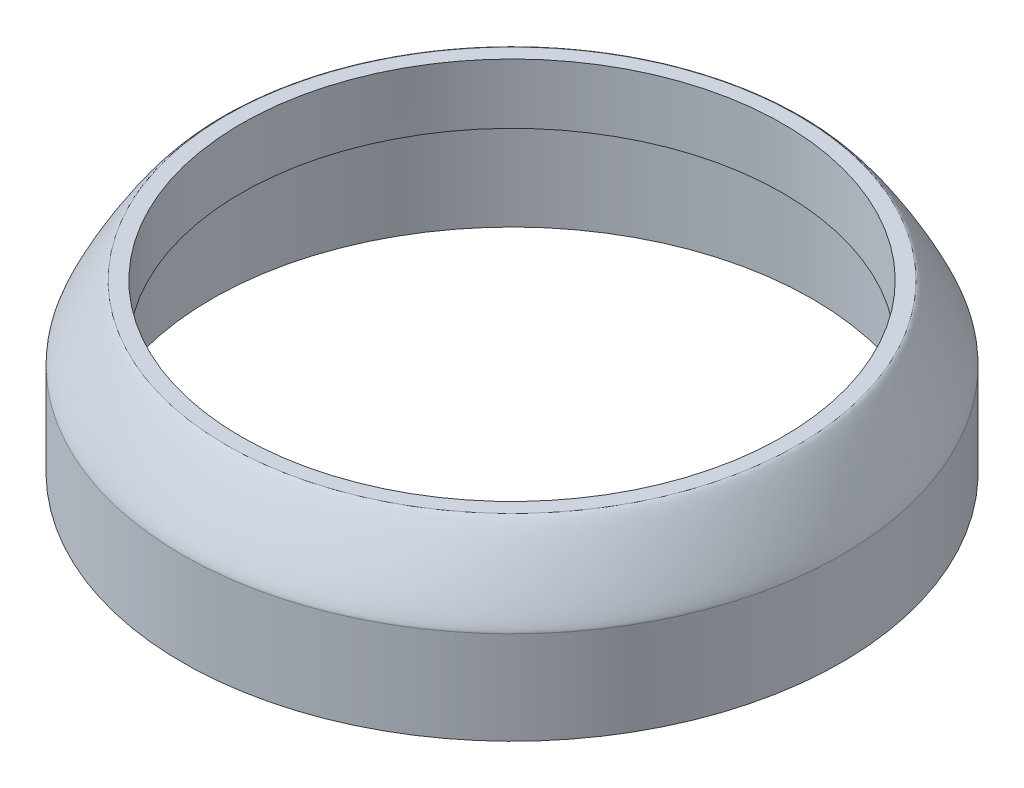
ISO-10303-21;
HEADER;
FILE_DESCRIPTION(('STEP AP214'),'2;1');
FILE_NAME('part.step','',(''),(''),'','','');
FILE_SCHEMA(('AUTOMOTIVE_DESIGN { 1 0 10303 214 1 1 1 1 }'));
ENDSEC;
DATA;
#1=APPLICATION_CONTEXT('core data for automotive mechanical design processes');
#2=APPLICATION_PROTOCOL_DEFINITION('international standard','automotive_design',2000,#1);
#3=PRODUCT_CONTEXT('',#1,'mechanical');
#4=PRODUCT('Part','Part','',(#3));
#5=PRODUCT_RELATED_PRODUCT_CATEGORY('part','',(#4));
#6=PRODUCT_DEFINITION_FORMATION('','',#4);
#7=PRODUCT_DEFINITION_CONTEXT('part definition',#1,'design');
#8=PRODUCT_DEFINITION('design','',#6,#7);
#9=PRODUCT_DEFINITION_SHAPE('','',#8);
#10=(LENGTH_UNIT() NAMED_UNIT(*) SI_UNIT(.MILLI.,.METRE.));
#11=(NAMED_UNIT(*) PLANE_ANGLE_UNIT() SI_UNIT($,.RADIAN.));
#12=(NAMED_UNIT(*) SI_UNIT($,.STERADIAN.) SOLID_ANGLE_UNIT());
#13=UNCERTAINTY_MEASURE_WITH_UNIT(LENGTH_MEASURE(1.E-05),#10,'distance_accuracy_value','');
#14=(GEOMETRIC_REPRESENTATION_CONTEXT(3) GLOBAL_UNCERTAINTY_ASSIGNED_CONTEXT((#13)) GLOBAL_UNIT_ASSIGNED_CONTEXT((#10,
#11,#12)) REPRESENTATION_CONTEXT('',''));
#15=CARTESIAN_POINT('',(0.,0.,0.));
#16=DIRECTION('',(0.,0.,1.));
#17=DIRECTION('',(1.,0.,0.));
#18=AXIS2_PLACEMENT_3D('',#15,#16,#17);
#19=CARTESIAN_POINT('',(0.,65.,0.));
#20=DIRECTION('',(0.,-1.,0.));
#21=DIRECTION('',(0.,0.,-1.));
#22=AXIS2_PLACEMENT_3D('',#19,#20,#21);
#23=CYLINDRICAL_SURFACE('',#22,90.);
#24=CARTESIAN_POINT('',(0.,45.,90.));
#25=CARTESIAN_POINT('',(11.7809724506332,45.,90.));
#26=CARTESIAN_POINT('',(23.5573095926679,45.,87.6575409000106));
#27=CARTESIAN_POINT('',(45.3257082330483,45.,78.640774952021));
#28=CARTESIAN_POINT('',(55.3092047979573,45.,71.9700158156213));
#29=CARTESIAN_POINT('',(71.9700158156213,45.,55.3092047979573));
#30=CARTESIAN_POINT('',(78.6407749520015,45.,45.3257082330954));
#31=CARTESIAN_POINT('',(87.6575409000302,45.,23.5573095926207));
#32=CARTESIAN_POINT('',(90.,45.,11.780972450639));
#33=CARTESIAN_POINT('',(90.,45.,-11.780972450639));
#34=CARTESIAN_POINT('',(87.6575409000405,45.,-23.5573095925958));
#35=CARTESIAN_POINT('',(78.6407749519911,45.,-45.3257082331205));
#36=CARTESIAN_POINT('',(71.9700158156186,45.,-55.30920479796));
#37=CARTESIAN_POINT('',(55.3092047979599,45.,-71.9700158156187));
#38=CARTESIAN_POINT('',(45.3257082330832,45.,-78.6407749520065));
#39=CARTESIAN_POINT('',(23.5573095926332,45.,-87.657540900025));
#40=CARTESIAN_POINT('',(11.780972450639,45.,-90.));
#41=CARTESIAN_POINT('',(-11.780972450639,45.,-90.));
#42=CARTESIAN_POINT('',(-23.5573095926632,45.,-87.6575409000126));
#43=CARTESIAN_POINT('',(-45.3257082330528,45.,-78.6407749520192));
#44=CARTESIAN_POINT('',(-55.3092047979599,45.,-71.9700158156186));
#45=CARTESIAN_POINT('',(-71.9700158156187,45.,-55.3092047979599));
#46=CARTESIAN_POINT('',(-78.6407749519963,45.,-45.3257082331078));
#47=CARTESIAN_POINT('',(-87.6575409000352,45.,-23.5573095926086));
#48=CARTESIAN_POINT('',(-90.,45.,-11.7809724506389));
#49=CARTESIAN_POINT('',(-90.,45.,11.7809724506392));
#50=CARTESIAN_POINT('',(-87.6575409000124,45.,23.5573095926636));
#51=CARTESIAN_POINT('',(-78.6407749520194,45.,45.3257082330523));
#52=CARTESIAN_POINT('',(-71.9700158155886,45.,55.3092047979899));
#53=CARTESIAN_POINT('',(-55.3092047979904,45.,71.9700158155883));
#54=CARTESIAN_POINT('',(-45.3257082330775,45.,78.6407749520089));
#55=CARTESIAN_POINT('',(-23.5573095926389,45.,87.6575409000227));
#56=CARTESIAN_POINT('',(-11.7809724506332,45.,90.));
#57=CARTESIAN_POINT('',(0.,45.,90.));
#58=(BOUNDED_CURVE() B_SPLINE_CURVE(3,(#24,#25,#26,#27,#28,#29,#30,#31,#32,#33,#34,#35,#36,#37,
#38,#39,#40,#41,#42,#43,#44,#45,#46,#47,#48,#49,#50,#51,#52,#53,#54,#55,#56,#57),.UNSPECIFIED.,
.T.,.F.) B_SPLINE_CURVE_WITH_KNOTS((4,2,2,2,2,2,2,2,2,2,2,2,2,2,2,2,4),(0.,0.392699081698724,
0.785398163397448,1.17809724509617,1.5707963267949,1.96349540849362,2.35619449019234,
2.74889357189107,3.14159265358979,3.53429173528852,3.92699081698724,4.31968989868597,
4.71238898038469,5.10508806208341,5.49778714378214,5.89048622548086,6.28318530717959),
.UNSPECIFIED.) CURVE() GEOMETRIC_REPRESENTATION_ITEM() RATIONAL_B_SPLINE_CURVE((1.,1.,1.,1.,1.,
1.,1.,1.,1.,1.,1.,1.,1.,1.,1.,1.,1.,1.,1.,1.,1.,1.,1.,1.,1.,1.,1.,1.,1.,1.,1.,1.,1.,1.)) REPRESENTATION_ITEM(''));
#59=CARTESIAN_POINT('',(0.,45.,90.));
#60=VERTEX_POINT('',#59);
#61=EDGE_CURVE('E12',#60,#60,#58,.F.);
#62=ORIENTED_EDGE('',*,*,#61,.T.);
#63=EDGE_LOOP('',(#62));
#64=FACE_BOUND('',#63,.T.);
#65=CARTESIAN_POINT('',(0.,19.6,0.));
#66=DIRECTION('',(0.,-1.,0.));
#67=DIRECTION('',(0.,0.,-1.));
#68=AXIS2_PLACEMENT_3D('',#65,#66,#67);
#69=CIRCLE('',#68,90.);
#70=CARTESIAN_POINT('',(0.,19.6,-90.));
#71=VERTEX_POINT('',#70);
#72=EDGE_CURVE('E134',#71,#71,#69,.T.);
#73=ORIENTED_EDGE('',*,*,#72,.F.);
#74=EDGE_LOOP('',(#73));
#75=FACE_BOUND('',#74,.T.);
#76=ADVANCED_FACE('F44',(#64,#75),#23,.T.);
#77=CARTESIAN_POINT('',(0.,48.6,0.));
#78=DIRECTION('',(0.,-1.,0.));
#79=DIRECTION('',(0.,0.,-1.));
#80=AXIS2_PLACEMENT_3D('',#77,#78,#79);
#81=CYLINDRICAL_SURFACE('',#80,82.);
#82=CARTESIAN_POINT('',(0.,48.6,0.));
#83=DIRECTION('',(0.,-1.,0.));
#84=DIRECTION('',(0.,0.,-1.));
#85=AXIS2_PLACEMENT_3D('',#82,#83,#84);
#86=CIRCLE('',#85,82.);
#87=CARTESIAN_POINT('',(0.,48.6,-82.));
#88=VERTEX_POINT('',#87);
#89=EDGE_CURVE('E137',#88,#88,#86,.T.);
#90=ORIENTED_EDGE('',*,*,#89,.F.);
#91=EDGE_LOOP('',(#90));
#92=FACE_BOUND('',#91,.T.);
#93=CARTESIAN_POINT('',(0.,19.6,0.));
#94=DIRECTION('',(0.,-1.,0.));
#95=DIRECTION('',(0.,0.,-1.));
#96=AXIS2_PLACEMENT_3D('',#93,#94,#95);
#97=CIRCLE('',#96,82.);
#98=CARTESIAN_POINT('',(0.,19.6,-82.));
#99=VERTEX_POINT('',#98);
#100=EDGE_CURVE('E131',#99,#99,#97,.T.);
#101=ORIENTED_EDGE('',*,*,#100,.T.);
#102=EDGE_LOOP('',(#101));
#103=FACE_BOUND('',#102,.T.);
#104=ADVANCED_FACE('F169',(#92,#103),#81,.F.);
#105=CARTESIAN_POINT('',(0.,35.,0.));
#106=DIRECTION('',(0.,1.,0.));
#107=DIRECTION('',(0.,0.,1.));
#108=AXIS2_PLACEMENT_3D('',#105,#106,#107);
#109=CYLINDRICAL_SURFACE('',#108,74.);
#110=CARTESIAN_POINT('',(0.,65.,0.));
#111=DIRECTION('',(0.,1.,0.));
#112=DIRECTION('',(0.,0.,1.));
#113=AXIS2_PLACEMENT_3D('',#110,#111,#112);
#114=CIRCLE('',#113,74.);
#115=CARTESIAN_POINT('',(0.,65.,74.));
#116=VERTEX_POINT('',#115);
#117=EDGE_CURVE('E141',#116,#116,#114,.T.);
#118=ORIENTED_EDGE('',*,*,#117,.T.);
#119=EDGE_LOOP('',(#118));
#120=FACE_BOUND('',#119,.T.);
#121=CARTESIAN_POINT('',(0.,48.6,0.));
#122=DIRECTION('',(0.,-1.,0.));
#123=DIRECTION('',(0.,0.,-1.));
#124=AXIS2_PLACEMENT_3D('',#121,#122,#123);
#125=CIRCLE('',#124,74.);
#126=CARTESIAN_POINT('',(0.,48.6,-74.));
#127=VERTEX_POINT('',#126);
#128=EDGE_CURVE('E140',#127,#127,#125,.F.);
#129=ORIENTED_EDGE('',*,*,#128,.F.);
#130=EDGE_LOOP('',(#129));
#131=FACE_BOUND('',#130,.T.);
#132=ADVANCED_FACE('F165',(#120,#131),#109,.F.);
#133=CARTESIAN_POINT('',(0.,65.,0.));
#134=DIRECTION('',(0.,1.,0.));
#135=DIRECTION('',(0.,0.,1.));
#136=AXIS2_PLACEMENT_3D('',#133,#134,#135);
#137=PLANE('',#136);
#138=CARTESIAN_POINT('',(0.,65.,78.));
#139=CARTESIAN_POINT('',(-10.2101761238821,65.,78.));
#140=CARTESIAN_POINT('',(-20.4163349802806,65.,75.9698687800081));
#141=CARTESIAN_POINT('',(-39.2822804686736,65.,68.1553382917526));
#142=CARTESIAN_POINT('',(-47.9346441582111,65.,62.3740137068549));
#143=CARTESIAN_POINT('',(-62.3740137068907,65.,47.9346441582462));
#144=CARTESIAN_POINT('',(-68.1553382917527,65.,39.2822804686734));
#145=CARTESIAN_POINT('',(-75.9698687800082,65.,20.4163349802804));
#146=CARTESIAN_POINT('',(-78.,65.,10.2101761238873));
#147=CARTESIAN_POINT('',(-78.,65.,-10.210176123887));
#148=CARTESIAN_POINT('',(-75.9698687800081,65.,-20.4163349802806));
#149=CARTESIAN_POINT('',(-68.1553382917526,65.,-39.2822804686736));
#150=CARTESIAN_POINT('',(-62.374013706853,65.,-47.934644158213));
#151=CARTESIAN_POINT('',(-47.9346441582485,65.,-62.3740137068884));
#152=CARTESIAN_POINT('',(-39.2822804686655,65.,-68.1553382917463));
#153=CARTESIAN_POINT('',(-20.4163349802883,65.,-75.9698687800145));
#154=CARTESIAN_POINT('',(-10.2101761238871,65.,-78.));
#155=CARTESIAN_POINT('',(10.2101761238871,65.,-78.));
#156=CARTESIAN_POINT('',(20.4163349802885,65.,-75.9698687800144));
#157=CARTESIAN_POINT('',(39.2822804686657,65.,-68.1553382917462));
#158=CARTESIAN_POINT('',(47.9346441582484,65.,-62.374013706853));
#159=CARTESIAN_POINT('',(62.3740137068529,65.,-47.9346441582485));
#160=CARTESIAN_POINT('',(68.1553382916786,65.,-39.2822804686873));
#161=CARTESIAN_POINT('',(75.9698687800822,65.,-20.4163349802668));
#162=CARTESIAN_POINT('',(78.,65.,-10.2101761238871));
#163=CARTESIAN_POINT('',(78.,65.,10.2101761238871));
#164=CARTESIAN_POINT('',(75.9698687800113,65.,20.4163349802667));
#165=CARTESIAN_POINT('',(68.1553382917495,65.,39.2822804686872));
#166=CARTESIAN_POINT('',(62.3740137069072,65.,47.9346441582651));
#167=CARTESIAN_POINT('',(47.9346441581943,65.,62.3740137068363));
#168=CARTESIAN_POINT('',(39.2822804686641,65.,68.1553382917664));
#169=CARTESIAN_POINT('',(20.4163349802899,65.,75.9698687799944));
#170=CARTESIAN_POINT('',(10.2101761238821,65.,78.));
#171=CARTESIAN_POINT('',(0.,65.,78.));
#172=(BOUNDED_CURVE() B_SPLINE_CURVE(3,(#138,#139,#140,#141,#142,#143,#144,#145,#146,#147,#148,
#149,#150,#151,#152,#153,#154,#155,#156,#157,#158,#159,#160,#161,#162,#163,#164,#165,#166,#167,
#168,#169,#170,#171),.UNSPECIFIED.,.T.,.F.) B_SPLINE_CURVE_WITH_KNOTS((4,2,2,2,2,2,2,2,2,2,2,2,
2,2,2,2,4),(0.,0.392699081698725,0.785398163397448,1.17809724509617,1.5707963267949,
1.96349540849362,2.35619449019234,2.74889357189107,3.14159265358979,3.53429173528852,
3.92699081698724,4.31968989868597,4.71238898038469,5.10508806208341,5.49778714378214,
5.89048622548086,6.28318530717959),
.UNSPECIFIED.) CURVE() GEOMETRIC_REPRESENTATION_ITEM() RATIONAL_B_SPLINE_CURVE((1.,1.,1.,1.,1.,
1.,1.,1.,1.,1.,1.,1.,1.,1.,1.,1.,1.,1.,1.,1.,1.,1.,1.,1.,1.,1.,1.,1.,1.,1.,1.,1.,1.,1.)) REPRESENTATION_ITEM(''));
#173=CARTESIAN_POINT('',(0.,65.,78.));
#174=VERTEX_POINT('',#173);
#175=EDGE_CURVE('E58',#174,#174,#172,.F.);
#176=ORIENTED_EDGE('',*,*,#175,.T.);
#177=EDGE_LOOP('',(#176));
#178=FACE_BOUND('',#177,.T.);
#179=ORIENTED_EDGE('',*,*,#117,.F.);
#180=EDGE_LOOP('',(#179));
#181=FACE_BOUND('',#180,.T.);
#182=ADVANCED_FACE('F155',(#178,#181),#137,.T.);
#183=CARTESIAN_POINT('',(0.,48.6,0.));
#184=DIRECTION('',(0.,-1.,0.));
#185=DIRECTION('',(0.,0.,-1.));
#186=AXIS2_PLACEMENT_3D('',#183,#184,#185);
#187=PLANE('',#186);
#188=CARTESIAN_POINT('',(76.,48.6,0.));
#189=DIRECTION('',(0.,-1.,0.));
#190=DIRECTION('',(0.,0.,-1.));
#191=AXIS2_PLACEMENT_3D('',#188,#189,#190);
#192=CIRCLE('',#191,1.);
#193=CARTESIAN_POINT('',(76.,48.6,-1.));
#194=VERTEX_POINT('',#193);
#195=EDGE_CURVE('E91',#194,#194,#192,.T.);
#196=ORIENTED_EDGE('',*,*,#195,.F.);
#197=EDGE_LOOP('',(#196));
#198=FACE_BOUND('',#197,.T.);
#199=CARTESIAN_POINT('',(0.,48.6,-76.));
#200=DIRECTION('',(0.,-1.,0.));
#201=DIRECTION('',(0.,0.,-1.));
#202=AXIS2_PLACEMENT_3D('',#199,#200,#201);
#203=CIRCLE('',#202,0.999999999999999);
#204=CARTESIAN_POINT('',(0.,48.6,-77.));
#205=VERTEX_POINT('',#204);
#206=EDGE_CURVE('E90',#205,#205,#203,.T.);
#207=ORIENTED_EDGE('',*,*,#206,.F.);
#208=EDGE_LOOP('',(#207));
#209=FACE_BOUND('',#208,.T.);
#210=CARTESIAN_POINT('',(-76.,48.6,0.));
#211=DIRECTION('',(0.,-1.,0.));
#212=DIRECTION('',(0.,0.,-1.));
#213=AXIS2_PLACEMENT_3D('',#210,#211,#212);
#214=CIRCLE('',#213,1.);
#215=CARTESIAN_POINT('',(-76.,48.6,-1.));
#216=VERTEX_POINT('',#215);
#217=EDGE_CURVE('E101',#216,#216,#214,.T.);
#218=ORIENTED_EDGE('',*,*,#217,.F.);
#219=EDGE_LOOP('',(#218));
#220=FACE_BOUND('',#219,.T.);
#221=ORIENTED_EDGE('',*,*,#89,.T.);
#222=EDGE_LOOP('',(#221));
#223=FACE_BOUND('',#222,.T.);
#224=ORIENTED_EDGE('',*,*,#128,.T.);
#225=EDGE_LOOP('',(#224));
#226=FACE_BOUND('',#225,.T.);
#227=ADVANCED_FACE('F164',(#198,#209,#220,#223,#226),#187,.T.);
#228=CARTESIAN_POINT('',(0.,19.6,0.));
#229=DIRECTION('',(0.,-1.,0.));
#230=DIRECTION('',(0.,0.,-1.));
#231=AXIS2_PLACEMENT_3D('',#228,#229,#230);
#232=PLANE('',#231);
#233=CARTESIAN_POINT('',(0.,19.6,-86.));
#234=DIRECTION('',(0.,-1.,0.));
#235=DIRECTION('',(0.,0.,-1.));
#236=AXIS2_PLACEMENT_3D('',#233,#234,#235);
#237=CIRCLE('',#236,2.5);
#238=CARTESIAN_POINT('',(0.,19.6,-88.5));
#239=VERTEX_POINT('',#238);
#240=EDGE_CURVE('E107',#239,#239,#237,.T.);
#241=ORIENTED_EDGE('',*,*,#240,.F.);
#242=EDGE_LOOP('',(#241));
#243=FACE_BOUND('',#242,.T.);
#244=CARTESIAN_POINT('',(86.,19.6,0.));
#245=DIRECTION('',(0.,-1.,0.));
#246=DIRECTION('',(0.,0.,-1.));
#247=AXIS2_PLACEMENT_3D('',#244,#245,#246);
#248=CIRCLE('',#247,2.5);
#249=CARTESIAN_POINT('',(86.,19.6,-2.5));
#250=VERTEX_POINT('',#249);
#251=EDGE_CURVE('E113',#250,#250,#248,.T.);
#252=ORIENTED_EDGE('',*,*,#251,.F.);
#253=EDGE_LOOP('',(#252));
#254=FACE_BOUND('',#253,.T.);
#255=CARTESIAN_POINT('',(0.,19.6,86.));
#256=DIRECTION('',(0.,-1.,0.));
#257=DIRECTION('',(0.,0.,-1.));
#258=AXIS2_PLACEMENT_3D('',#255,#256,#257);
#259=CIRCLE('',#258,2.5);
#260=CARTESIAN_POINT('',(0.,19.6,83.5));
#261=VERTEX_POINT('',#260);
#262=EDGE_CURVE('E119',#261,#261,#259,.T.);
#263=ORIENTED_EDGE('',*,*,#262,.F.);
#264=EDGE_LOOP('',(#263));
#265=FACE_BOUND('',#264,.T.);
#266=CARTESIAN_POINT('',(-86.,19.6,0.));
#267=DIRECTION('',(0.,-1.,0.));
#268=DIRECTION('',(0.,0.,-1.));
#269=AXIS2_PLACEMENT_3D('',#266,#267,#268);
#270=CIRCLE('',#269,2.5);
#271=CARTESIAN_POINT('',(-86.,19.6,-2.5));
#272=VERTEX_POINT('',#271);
#273=EDGE_CURVE('E125',#272,#272,#270,.T.);
#274=ORIENTED_EDGE('',*,*,#273,.F.);
#275=EDGE_LOOP('',(#274));
#276=FACE_BOUND('',#275,.T.);
#277=ORIENTED_EDGE('',*,*,#100,.F.);
#278=EDGE_LOOP('',(#277));
#279=FACE_BOUND('',#278,.T.);
#280=ORIENTED_EDGE('',*,*,#72,.T.);
#281=EDGE_LOOP('',(#280));
#282=FACE_BOUND('',#281,.T.);
#283=ADVANCED_FACE('F193',(#243,#254,#265,#276,#279,#282),#232,.T.);
#284=CARTESIAN_POINT('',(-86.,27.6,0.));
#285=DIRECTION('',(0.,-1.,0.));
#286=DIRECTION('',(0.,0.,-1.));
#287=AXIS2_PLACEMENT_3D('',#284,#285,#286);
#288=CONICAL_SURFACE('',#287,2.5,1.02974425867666);
#289=CARTESIAN_POINT('',(-86.,29.1021515475689,0.));
#290=VERTEX_POINT('',#289);
#291=VERTEX_LOOP('',#290);
#292=FACE_BOUND('',#291,.T.);
#293=CARTESIAN_POINT('',(-86.,27.6,0.));
#294=DIRECTION('',(0.,-1.,0.));
#295=DIRECTION('',(0.,0.,-1.));
#296=AXIS2_PLACEMENT_3D('',#293,#294,#295);
#297=CIRCLE('',#296,2.5);
#298=CARTESIAN_POINT('',(-86.,27.6,-2.5));
#299=VERTEX_POINT('',#298);
#300=EDGE_CURVE('E128',#299,#299,#297,.T.);
#301=ORIENTED_EDGE('',*,*,#300,.T.);
#302=EDGE_LOOP('',(#301));
#303=FACE_BOUND('',#302,.T.);
#304=ADVANCED_FACE('F195',(#292,#303),#288,.F.);
#305=CARTESIAN_POINT('',(-86.,19.6,0.));
#306=DIRECTION('',(0.,-1.,0.));
#307=DIRECTION('',(0.,0.,-1.));
#308=AXIS2_PLACEMENT_3D('',#305,#306,#307);
#309=CYLINDRICAL_SURFACE('',#308,2.5);
#310=ORIENTED_EDGE('',*,*,#300,.F.);
#311=EDGE_LOOP('',(#310));
#312=FACE_BOUND('',#311,.T.);
#313=ORIENTED_EDGE('',*,*,#273,.T.);
#314=EDGE_LOOP('',(#313));
#315=FACE_BOUND('',#314,.T.);
#316=ADVANCED_FACE('F202',(#312,#315),#309,.F.);
#317=CARTESIAN_POINT('',(0.,27.6,86.));
#318=DIRECTION('',(0.,-1.,0.));
#319=DIRECTION('',(0.,0.,-1.));
#320=AXIS2_PLACEMENT_3D('',#317,#318,#319);
#321=CONICAL_SURFACE('',#320,2.5,1.02974425867665);
#322=CARTESIAN_POINT('',(0.,29.1021515475689,86.));
#323=VERTEX_POINT('',#322);
#324=VERTEX_LOOP('',#323);
#325=FACE_BOUND('',#324,.T.);
#326=CARTESIAN_POINT('',(0.,27.6,86.));
#327=DIRECTION('',(0.,-1.,0.));
#328=DIRECTION('',(0.,0.,-1.));
#329=AXIS2_PLACEMENT_3D('',#326,#327,#328);
#330=CIRCLE('',#329,2.5);
#331=CARTESIAN_POINT('',(0.,27.6,83.5));
#332=VERTEX_POINT('',#331);
#333=EDGE_CURVE('E122',#332,#332,#330,.T.);
#334=ORIENTED_EDGE('',*,*,#333,.T.);
#335=EDGE_LOOP('',(#334));
#336=FACE_BOUND('',#335,.T.);
#337=ADVANCED_FACE('F319',(#325,#336),#321,.F.);
#338=CARTESIAN_POINT('',(0.,19.6,86.));
#339=DIRECTION('',(0.,-1.,0.));
#340=DIRECTION('',(0.,0.,-1.));
#341=AXIS2_PLACEMENT_3D('',#338,#339,#340);
#342=CYLINDRICAL_SURFACE('',#341,2.5);
#343=ORIENTED_EDGE('',*,*,#333,.F.);
#344=EDGE_LOOP('',(#343));
#345=FACE_BOUND('',#344,.T.);
#346=ORIENTED_EDGE('',*,*,#262,.T.);
#347=EDGE_LOOP('',(#346));
#348=FACE_BOUND('',#347,.T.);
#349=ADVANCED_FACE('F315',(#345,#348),#342,.F.);
#350=CARTESIAN_POINT('',(86.,27.6,0.));
#351=DIRECTION('',(0.,-1.,0.));
#352=DIRECTION('',(0.,0.,-1.));
#353=AXIS2_PLACEMENT_3D('',#350,#351,#352);
#354=CONICAL_SURFACE('',#353,2.5,1.02974425867666);
#355=CARTESIAN_POINT('',(86.,29.1021515475689,0.));
#356=VERTEX_POINT('',#355);
#357=VERTEX_LOOP('',#356);
#358=FACE_BOUND('',#357,.T.);
#359=CARTESIAN_POINT('',(86.,27.6,0.));
#360=DIRECTION('',(0.,-1.,0.));
#361=DIRECTION('',(0.,0.,-1.));
#362=AXIS2_PLACEMENT_3D('',#359,#360,#361);
#363=CIRCLE('',#362,2.5);
#364=CARTESIAN_POINT('',(86.,27.6,-2.5));
#365=VERTEX_POINT('',#364);
#366=EDGE_CURVE('E116',#365,#365,#363,.T.);
#367=ORIENTED_EDGE('',*,*,#366,.T.);
#368=EDGE_LOOP('',(#367));
#369=FACE_BOUND('',#368,.T.);
#370=ADVANCED_FACE('F311',(#358,#369),#354,.F.);
#371=CARTESIAN_POINT('',(86.,19.6,0.));
#372=DIRECTION('',(0.,-1.,0.));
#373=DIRECTION('',(0.,0.,-1.));
#374=AXIS2_PLACEMENT_3D('',#371,#372,#373);
#375=CYLINDRICAL_SURFACE('',#374,2.5);
#376=ORIENTED_EDGE('',*,*,#366,.F.);
#377=EDGE_LOOP('',(#376));
#378=FACE_BOUND('',#377,.T.);
#379=ORIENTED_EDGE('',*,*,#251,.T.);
#380=EDGE_LOOP('',(#379));
#381=FACE_BOUND('',#380,.T.);
#382=ADVANCED_FACE('F307',(#378,#381),#375,.F.);
#383=CARTESIAN_POINT('',(0.,27.6,-86.));
#384=DIRECTION('',(0.,-1.,0.));
#385=DIRECTION('',(0.,0.,-1.));
#386=AXIS2_PLACEMENT_3D('',#383,#384,#385);
#387=CONICAL_SURFACE('',#386,2.5,1.02974425867665);
#388=CARTESIAN_POINT('',(0.,29.1021515475689,-86.));
#389=VERTEX_POINT('',#388);
#390=VERTEX_LOOP('',#389);
#391=FACE_BOUND('',#390,.T.);
#392=CARTESIAN_POINT('',(0.,27.6,-86.));
#393=DIRECTION('',(0.,-1.,0.));
#394=DIRECTION('',(0.,0.,-1.));
#395=AXIS2_PLACEMENT_3D('',#392,#393,#394);
#396=CIRCLE('',#395,2.5);
#397=CARTESIAN_POINT('',(0.,27.6,-88.5));
#398=VERTEX_POINT('',#397);
#399=EDGE_CURVE('E110',#398,#398,#396,.T.);
#400=ORIENTED_EDGE('',*,*,#399,.T.);
#401=EDGE_LOOP('',(#400));
#402=FACE_BOUND('',#401,.T.);
#403=ADVANCED_FACE('F303',(#391,#402),#387,.F.);
#404=CARTESIAN_POINT('',(0.,19.6,-86.));
#405=DIRECTION('',(0.,-1.,0.));
#406=DIRECTION('',(0.,0.,-1.));
#407=AXIS2_PLACEMENT_3D('',#404,#405,#406);
#408=CYLINDRICAL_SURFACE('',#407,2.5);
#409=ORIENTED_EDGE('',*,*,#399,.F.);
#410=EDGE_LOOP('',(#409));
#411=FACE_BOUND('',#410,.T.);
#412=ORIENTED_EDGE('',*,*,#240,.T.);
#413=EDGE_LOOP('',(#412));
#414=FACE_BOUND('',#413,.T.);
#415=ADVANCED_FACE('F300',(#411,#414),#408,.F.);
#416=CARTESIAN_POINT('',(0.,65.,78.));
#417=CARTESIAN_POINT('',(10.2101761238821,65.,78.));
#418=CARTESIAN_POINT('',(20.4163349802899,65.,75.9698687799944));
#419=CARTESIAN_POINT('',(39.2822804686641,65.,68.1553382917664));
#420=CARTESIAN_POINT('',(47.9346441581943,65.,62.3740137068363));
#421=CARTESIAN_POINT('',(62.3740137069072,65.,47.9346441582651));
#422=CARTESIAN_POINT('',(68.1553382917495,65.,39.2822804686872));
#423=CARTESIAN_POINT('',(75.9698687800113,65.,20.4163349802667));
#424=CARTESIAN_POINT('',(78.,65.,10.2101761238871));
#425=CARTESIAN_POINT('',(78.,65.,-10.2101761238871));
#426=CARTESIAN_POINT('',(75.9698687800822,65.,-20.4163349802668));
#427=CARTESIAN_POINT('',(68.1553382916786,65.,-39.2822804686873));
#428=CARTESIAN_POINT('',(62.3740137068529,65.,-47.9346441582485));
#429=CARTESIAN_POINT('',(47.9346441582484,65.,-62.374013706853));
#430=CARTESIAN_POINT('',(39.2822804686657,65.,-68.1553382917462));
#431=CARTESIAN_POINT('',(20.4163349802885,65.,-75.9698687800144));
#432=CARTESIAN_POINT('',(10.2101761238871,65.,-78.));
#433=CARTESIAN_POINT('',(-10.2101761238871,65.,-78.));
#434=CARTESIAN_POINT('',(-20.4163349802883,65.,-75.9698687800145));
#435=CARTESIAN_POINT('',(-39.2822804686655,65.,-68.1553382917463));
#436=CARTESIAN_POINT('',(-47.9346441582485,65.,-62.3740137068884));
#437=CARTESIAN_POINT('',(-62.374013706853,65.,-47.934644158213));
#438=CARTESIAN_POINT('',(-68.1553382917526,65.,-39.2822804686736));
#439=CARTESIAN_POINT('',(-75.9698687800081,65.,-20.4163349802806));
#440=CARTESIAN_POINT('',(-78.,65.,-10.210176123887));
#441=CARTESIAN_POINT('',(-78.,65.,10.2101761238873));
#442=CARTESIAN_POINT('',(-75.9698687800082,65.,20.4163349802804));
#443=CARTESIAN_POINT('',(-68.1553382917527,65.,39.2822804686734));
#444=CARTESIAN_POINT('',(-62.3740137068907,65.,47.9346441582462));
#445=CARTESIAN_POINT('',(-47.9346441582111,65.,62.3740137068549));
#446=CARTESIAN_POINT('',(-39.2822804686736,65.,68.1553382917526));
#447=CARTESIAN_POINT('',(-20.4163349802806,65.,75.9698687800081));
#448=CARTESIAN_POINT('',(-10.2101761238821,65.,78.));
#449=CARTESIAN_POINT('',(0.,65.,78.));
#450=CARTESIAN_POINT('',(0.,65.,90.));
#451=CARTESIAN_POINT('',(11.7809724506332,65.,90.));
#452=CARTESIAN_POINT('',(23.5573095926653,65.,87.6575409000044));
#453=CARTESIAN_POINT('',(45.3257082330508,65.,78.6407749520272));
#454=CARTESIAN_POINT('',(55.3092047979219,65.,71.9700158155859));
#455=CARTESIAN_POINT('',(71.9700158156567,65.,55.3092047979927));
#456=CARTESIAN_POINT('',(78.6407749520077,65.,45.3257082331333));
#457=CARTESIAN_POINT('',(87.657540900024,65.,23.5573095925828));
#458=CARTESIAN_POINT('',(90.,65.,11.780972450639));
#459=CARTESIAN_POINT('',(90.,65.,-11.780972450639));
#460=CARTESIAN_POINT('',(87.6575409000948,65.,-23.5573095925828));
#461=CARTESIAN_POINT('',(78.6407749519368,65.,-45.3257082331334));
#462=CARTESIAN_POINT('',(71.9700158156541,65.0000000000708,-55.3092047979954));
#463=CARTESIAN_POINT('',(55.3092047979244,64.9999999999291,-71.9700158155833));
#464=CARTESIAN_POINT('',(45.3257082330513,65.,-78.6407749520149));
#465=CARTESIAN_POINT('',(23.5573095926652,65.,-87.6575409000167));
#466=CARTESIAN_POINT('',(11.780972450639,65.,-90.));
#467=CARTESIAN_POINT('',(-11.780972450639,65.,-90.));
#468=CARTESIAN_POINT('',(-23.5573095926649,65.,-87.6575409000168));
#469=CARTESIAN_POINT('',(-45.325708233051,65.,-78.640774952015));
#470=CARTESIAN_POINT('',(-55.3092047979954,65.,-71.9700158157249));
#471=CARTESIAN_POINT('',(-71.9700158155833,65.,-55.3092047978536));
#472=CARTESIAN_POINT('',(-78.6407749520004,65.,-45.3257082331095));
#473=CARTESIAN_POINT('',(-87.6575409000312,65.,-23.5573095926069));
#474=CARTESIAN_POINT('',(-90.,65.,-11.7809724506389));
#475=CARTESIAN_POINT('',(-90.,65.,11.7809724506392));
#476=CARTESIAN_POINT('',(-87.6575408999604,65.,23.5573095926421));
#477=CARTESIAN_POINT('',(-78.6407749520714,65.,45.3257082330738));
#478=CARTESIAN_POINT('',(-71.9700158156594,65.,55.30920479799));
#479=CARTESIAN_POINT('',(-55.3092047979195,65.,71.9700158155882));
#480=CARTESIAN_POINT('',(-45.3257082330741,65.,78.6407749520004));
#481=CARTESIAN_POINT('',(-23.5573095926424,65.,87.6575409000312));
#482=CARTESIAN_POINT('',(-11.7809724506332,65.,90.));
#483=CARTESIAN_POINT('',(0.,65.,90.));
#484=CARTESIAN_POINT('',(0.,45.,90.));
#485=CARTESIAN_POINT('',(11.7809724506332,45.,90.));
#486=CARTESIAN_POINT('',(23.5573095926679,45.,87.6575409000106));
#487=CARTESIAN_POINT('',(45.3257082330483,45.,78.640774952021));
#488=CARTESIAN_POINT('',(55.3092047979573,45.,71.9700158156213));
#489=CARTESIAN_POINT('',(71.9700158156213,45.,55.3092047979573));
#490=CARTESIAN_POINT('',(78.6407749520015,45.,45.3257082330954));
#491=CARTESIAN_POINT('',(87.6575409000302,45.,23.5573095926207));
#492=CARTESIAN_POINT('',(90.,45.,11.780972450639));
#493=CARTESIAN_POINT('',(90.,45.,-11.780972450639));
#494=CARTESIAN_POINT('',(87.6575409000405,45.,-23.5573095925958));
#495=CARTESIAN_POINT('',(78.6407749519911,45.,-45.3257082331205));
#496=CARTESIAN_POINT('',(71.9700158156186,45.,-55.30920479796));
#497=CARTESIAN_POINT('',(55.3092047979599,45.,-71.9700158156187));
#498=CARTESIAN_POINT('',(45.3257082330832,45.,-78.6407749520065));
#499=CARTESIAN_POINT('',(23.5573095926332,45.,-87.657540900025));
#500=CARTESIAN_POINT('',(11.780972450639,45.,-90.));
#501=CARTESIAN_POINT('',(-11.780972450639,45.,-90.));
#502=CARTESIAN_POINT('',(-23.5573095926632,45.,-87.6575409000126));
#503=CARTESIAN_POINT('',(-45.3257082330528,45.,-78.6407749520192));
#504=CARTESIAN_POINT('',(-55.3092047979599,45.,-71.9700158156186));
#505=CARTESIAN_POINT('',(-71.9700158156187,45.,-55.3092047979599));
#506=CARTESIAN_POINT('',(-78.6407749519963,45.,-45.3257082331078));
#507=CARTESIAN_POINT('',(-87.6575409000352,45.,-23.5573095926086));
#508=CARTESIAN_POINT('',(-90.,45.,-11.7809724506389));
#509=CARTESIAN_POINT('',(-90.,45.,11.7809724506392));
#510=CARTESIAN_POINT('',(-87.6575409000124,45.,23.5573095926636));
#511=CARTESIAN_POINT('',(-78.6407749520194,45.,45.3257082330523));
#512=CARTESIAN_POINT('',(-71.9700158155886,45.,55.3092047979899));
#513=CARTESIAN_POINT('',(-55.3092047979904,45.,71.9700158155883));
#514=CARTESIAN_POINT('',(-45.3257082330775,45.,78.6407749520089));
#515=CARTESIAN_POINT('',(-23.5573095926389,45.,87.6575409000227));
#516=CARTESIAN_POINT('',(-11.7809724506332,45.,90.));
#517=CARTESIAN_POINT('',(0.,45.,90.));
#518=(BOUNDED_SURFACE() B_SPLINE_SURFACE(2,3,((#416,#417,#418,#419,#420,#421,#422,#423,#424,
#425,#426,#427,#428,#429,#430,#431,#432,#433,#434,#435,#436,#437,#438,#439,#440,#441,#442,#443,
#444,#445,#446,#447,#448,#449),(#450,#451,#452,#453,#454,#455,#456,#457,#458,#459,#460,#461,
#462,#463,#464,#465,#466,#467,#468,#469,#470,#471,#472,#473,#474,#475,#476,#477,#478,#479,#480,
#481,#482,#483),(#484,#485,#486,#487,#488,#489,#490,#491,#492,#493,#494,#495,#496,#497,#498,
#499,#500,#501,#502,#503,#504,#505,#506,#507,#508,#509,#510,#511,#512,#513,#514,#515,#516,
#517)),.UNSPECIFIED.,.F.,.T.,.F.) B_SPLINE_SURFACE_WITH_KNOTS((3,3),(4,2,2,2,2,2,2,2,2,2,2,2,2,
2,2,2,4),(0.,1.),(0.,0.392699081698724,0.785398163397448,1.17809724509617,1.5707963267949,
1.96349540849362,2.35619449019234,2.74889357189107,3.14159265358979,3.53429173528852,
3.92699081698724,4.31968989868597,4.71238898038469,5.10508806208341,5.49778714378214,
5.89048622548086,6.28318530717959),
.UNSPECIFIED.) GEOMETRIC_REPRESENTATION_ITEM() RATIONAL_B_SPLINE_SURFACE(((1.,1.,1.,1.,1.,1.,1.,
1.,1.,1.,1.,1.,1.,1.,1.,1.,1.,1.,1.,1.,1.,1.,1.,1.,1.,1.,1.,1.,1.,1.,1.,1.,1.,1.),
(0.111111111111111,0.111111111111111,0.111111111111111,0.111111111111111,0.111111111111111,
0.111111111111111,0.111111111111111,0.111111111111111,0.111111111111111,0.111111111111111,
0.111111111111111,0.111111111111111,0.111111111111111,0.111111111111111,0.111111111111111,
0.111111111111111,0.111111111111111,0.111111111111111,0.111111111111111,0.111111111111111,
0.111111111111111,0.111111111111111,0.111111111111111,0.111111111111111,0.111111111111111,
0.111111111111111,0.111111111111111,0.111111111111111,0.111111111111111,0.111111111111111,
0.111111111111111,0.111111111111111,0.111111111111111,0.111111111111111),(1.,1.,1.,1.,1.,1.,1.,
1.,1.,1.,1.,1.,1.,1.,1.,1.,1.,1.,1.,1.,1.,1.,1.,1.,1.,1.,1.,1.,1.,1.,1.,1.,1.,1.))) REPRESENTATION_ITEM('') SURFACE());
#519=ORIENTED_EDGE('',*,*,#61,.F.);
#520=EDGE_LOOP('',(#519));
#521=FACE_BOUND('',#520,.T.);
#522=ORIENTED_EDGE('',*,*,#175,.F.);
#523=EDGE_LOOP('',(#522));
#524=FACE_BOUND('',#523,.T.);
#525=ADVANCED_FACE('F47',(#521,#524),#518,.T.);
#526=CARTESIAN_POINT('',(-76.,55.9991393809724,0.));
#527=DIRECTION('',(0.,-1.,0.));
#528=DIRECTION('',(0.,0.,-1.));
#529=AXIS2_PLACEMENT_3D('',#526,#527,#528);
#530=CONICAL_SURFACE('',#529,1.,1.02974425867666);
#531=CARTESIAN_POINT('',(-76.,56.6,0.));
#532=VERTEX_POINT('',#531);
#533=VERTEX_LOOP('',#532);
#534=FACE_BOUND('',#533,.T.);
#535=CARTESIAN_POINT('',(-76.,55.9991393809724,0.));
#536=DIRECTION('',(0.,-1.,0.));
#537=DIRECTION('',(0.,0.,-1.));
#538=AXIS2_PLACEMENT_3D('',#535,#536,#537);
#539=CIRCLE('',#538,1.);
#540=CARTESIAN_POINT('',(-76.,55.9991393809724,-1.));
#541=VERTEX_POINT('',#540);
#542=EDGE_CURVE('E104',#541,#541,#539,.T.);
#543=ORIENTED_EDGE('',*,*,#542,.T.);
#544=EDGE_LOOP('',(#543));
#545=FACE_BOUND('',#544,.T.);
#546=ADVANCED_FACE('F246',(#534,#545),#530,.F.);
#547=CARTESIAN_POINT('',(-76.,48.6,0.));
#548=DIRECTION('',(0.,-1.,0.));
#549=DIRECTION('',(0.,0.,-1.));
#550=AXIS2_PLACEMENT_3D('',#547,#548,#549);
#551=CYLINDRICAL_SURFACE('',#550,1.);
#552=ORIENTED_EDGE('',*,*,#542,.F.);
#553=EDGE_LOOP('',(#552));
#554=FACE_BOUND('',#553,.T.);
#555=ORIENTED_EDGE('',*,*,#217,.T.);
#556=EDGE_LOOP('',(#555));
#557=FACE_BOUND('',#556,.T.);
#558=ADVANCED_FACE('F251',(#554,#557),#551,.F.);
#559=CARTESIAN_POINT('',(0.,55.9991393809724,-76.));
#560=DIRECTION('',(0.,-1.,0.));
#561=DIRECTION('',(0.,0.,-1.));
#562=AXIS2_PLACEMENT_3D('',#559,#560,#561);
#563=CONICAL_SURFACE('',#562,0.999999999999998,1.02974425867665);
#564=CARTESIAN_POINT('',(0.,56.6,-76.));
#565=VERTEX_POINT('',#564);
#566=VERTEX_LOOP('',#565);
#567=FACE_BOUND('',#566,.T.);
#568=CARTESIAN_POINT('',(0.,55.9991393809724,-76.));
#569=DIRECTION('',(0.,-1.,0.));
#570=DIRECTION('',(0.,0.,-1.));
#571=AXIS2_PLACEMENT_3D('',#568,#569,#570);
#572=CIRCLE('',#571,0.999999999999998);
#573=CARTESIAN_POINT('',(0.,55.9991393809724,-77.));
#574=VERTEX_POINT('',#573);
#575=EDGE_CURVE('E94',#574,#574,#572,.T.);
#576=ORIENTED_EDGE('',*,*,#575,.T.);
#577=EDGE_LOOP('',(#576));
#578=FACE_BOUND('',#577,.T.);
#579=ADVANCED_FACE('F261',(#567,#578),#563,.F.);
#580=CARTESIAN_POINT('',(0.,48.6,-76.));
#581=DIRECTION('',(0.,-1.,0.));
#582=DIRECTION('',(0.,0.,-1.));
#583=AXIS2_PLACEMENT_3D('',#580,#581,#582);
#584=CYLINDRICAL_SURFACE('',#583,0.999999999999999);
#585=ORIENTED_EDGE('',*,*,#575,.F.);
#586=EDGE_LOOP('',(#585));
#587=FACE_BOUND('',#586,.T.);
#588=ORIENTED_EDGE('',*,*,#206,.T.);
#589=EDGE_LOOP('',(#588));
#590=FACE_BOUND('',#589,.T.);
#591=ADVANCED_FACE('F84',(#587,#590),#584,.F.);
#592=CARTESIAN_POINT('',(76.,55.9991393809724,0.));
#593=DIRECTION('',(0.,-1.,0.));
#594=DIRECTION('',(0.,0.,-1.));
#595=AXIS2_PLACEMENT_3D('',#592,#593,#594);
#596=CONICAL_SURFACE('',#595,1.,1.02974425867666);
#597=CARTESIAN_POINT('',(76.,56.6,0.));
#598=VERTEX_POINT('',#597);
#599=VERTEX_LOOP('',#598);
#600=FACE_BOUND('',#599,.T.);
#601=CARTESIAN_POINT('',(76.,55.9991393809724,0.));
#602=DIRECTION('',(0.,-1.,0.));
#603=DIRECTION('',(0.,0.,-1.));
#604=AXIS2_PLACEMENT_3D('',#601,#602,#603);
#605=CIRCLE('',#604,1.);
#606=CARTESIAN_POINT('',(76.,55.9991393809724,-1.));
#607=VERTEX_POINT('',#606);
#608=EDGE_CURVE('E88',#607,#607,#605,.T.);
#609=ORIENTED_EDGE('',*,*,#608,.T.);
#610=EDGE_LOOP('',(#609));
#611=FACE_BOUND('',#610,.T.);
#612=ADVANCED_FACE('F80',(#600,#611),#596,.F.);
#613=CARTESIAN_POINT('',(76.,48.6,0.));
#614=DIRECTION('',(0.,-1.,0.));
#615=DIRECTION('',(0.,0.,-1.));
#616=AXIS2_PLACEMENT_3D('',#613,#614,#615);
#617=CYLINDRICAL_SURFACE('',#616,1.);
#618=ORIENTED_EDGE('',*,*,#608,.F.);
#619=EDGE_LOOP('',(#618));
#620=FACE_BOUND('',#619,.T.);
#621=ORIENTED_EDGE('',*,*,#195,.T.);
#622=EDGE_LOOP('',(#621));
#623=FACE_BOUND('',#622,.T.);
#624=ADVANCED_FACE('F83',(#620,#623),#617,.F.);
#625=CLOSED_SHELL('',(#76,#104,#132,#182,#227,#283,#304,#316,#337,#349,#370,#382,#403,#415,#525,
#546,#558,#579,#591,#612,#624));
#626=MANIFOLD_SOLID_BREP('B2',#625);
#627=ADVANCED_BREP_SHAPE_REPRESENTATION('',(#18,#626),#14);
#628=SHAPE_DEFINITION_REPRESENTATION(#9,#627);
ENDSEC;
END-ISO-10303-21;
